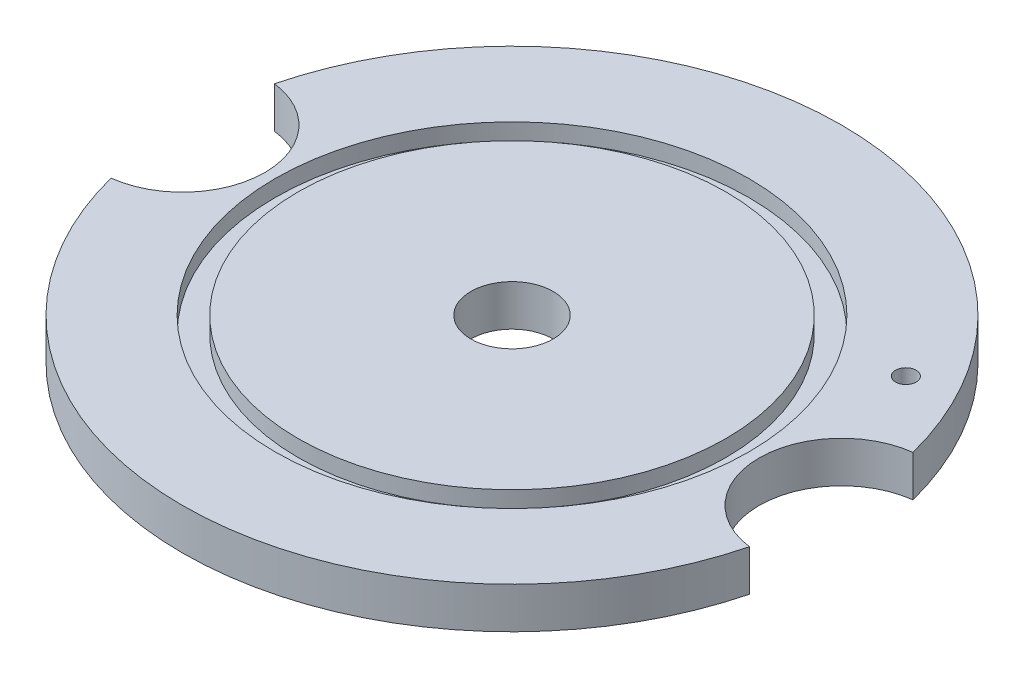
ISO-10303-21;
HEADER;
FILE_DESCRIPTION(('STEP AP214'),'2;1');
FILE_NAME('part.step','',(''),(''),'','','');
FILE_SCHEMA(('AUTOMOTIVE_DESIGN { 1 0 10303 214 1 1 1 1 }'));
ENDSEC;
DATA;
#1=APPLICATION_CONTEXT('core data for automotive mechanical design processes');
#2=APPLICATION_PROTOCOL_DEFINITION('international standard','automotive_design',2000,#1);
#3=PRODUCT_CONTEXT('',#1,'mechanical');
#4=PRODUCT('Part','Part','',(#3));
#5=PRODUCT_RELATED_PRODUCT_CATEGORY('part','',(#4));
#6=PRODUCT_DEFINITION_FORMATION('','',#4);
#7=PRODUCT_DEFINITION_CONTEXT('part definition',#1,'design');
#8=PRODUCT_DEFINITION('design','',#6,#7);
#9=PRODUCT_DEFINITION_SHAPE('','',#8);
#10=(LENGTH_UNIT() NAMED_UNIT(*) SI_UNIT(.MILLI.,.METRE.));
#11=(NAMED_UNIT(*) PLANE_ANGLE_UNIT() SI_UNIT($,.RADIAN.));
#12=(NAMED_UNIT(*) SI_UNIT($,.STERADIAN.) SOLID_ANGLE_UNIT());
#13=UNCERTAINTY_MEASURE_WITH_UNIT(LENGTH_MEASURE(1.E-05),#10,'distance_accuracy_value','');
#14=(GEOMETRIC_REPRESENTATION_CONTEXT(3) GLOBAL_UNCERTAINTY_ASSIGNED_CONTEXT((#13)) GLOBAL_UNIT_ASSIGNED_CONTEXT((#10,
#11,#12)) REPRESENTATION_CONTEXT('',''));
#15=CARTESIAN_POINT('',(0.,0.,0.));
#16=DIRECTION('',(0.,0.,1.));
#17=DIRECTION('',(1.,0.,0.));
#18=AXIS2_PLACEMENT_3D('',#15,#16,#17);
#19=CARTESIAN_POINT('',(0.,0.,0.));
#20=DIRECTION('',(0.,-1.,0.));
#21=DIRECTION('',(0.,0.,-1.));
#22=AXIS2_PLACEMENT_3D('',#19,#20,#21);
#23=CYLINDRICAL_SURFACE('',#22,50.8);
#24=CARTESIAN_POINT('',(0.,0.,0.));
#25=DIRECTION('',(0.,-1.,0.));
#26=DIRECTION('',(0.,0.,-1.));
#27=AXIS2_PLACEMENT_3D('',#24,#25,#26);
#28=CIRCLE('',#27,50.8);
#29=CARTESIAN_POINT('',(49.2125,0.,12.6003906189451));
#30=VERTEX_POINT('',#29);
#31=CARTESIAN_POINT('',(-49.2125,0.,12.6003906189451));
#32=VERTEX_POINT('',#31);
#33=EDGE_CURVE('E60',#30,#32,#28,.T.);
#34=ORIENTED_EDGE('',*,*,#33,.F.);
#35=DIRECTION('',(0.,1.,0.));
#36=VECTOR('',#35,1.);
#37=CARTESIAN_POINT('',(49.2125,3.175,12.6003906189451));
#38=LINE('',#37,#36);
#39=CARTESIAN_POINT('',(49.2125,6.35,12.6003906189451));
#40=VERTEX_POINT('',#39);
#41=EDGE_CURVE('E11',#30,#40,#38,.T.);
#42=ORIENTED_EDGE('',*,*,#41,.T.);
#43=CARTESIAN_POINT('',(0.,6.35,0.));
#44=DIRECTION('',(0.,-1.,0.));
#45=DIRECTION('',(0.,0.,-1.));
#46=AXIS2_PLACEMENT_3D('',#43,#44,#45);
#47=CIRCLE('',#46,50.8);
#48=CARTESIAN_POINT('',(-49.2125,6.35,12.6003906189451));
#49=VERTEX_POINT('',#48);
#50=EDGE_CURVE('E99',#40,#49,#47,.T.);
#51=ORIENTED_EDGE('',*,*,#50,.T.);
#52=DIRECTION('',(0.,1.,0.));
#53=VECTOR('',#52,1.);
#54=CARTESIAN_POINT('',(-49.2125,3.175,12.6003906189451));
#55=LINE('',#54,#53);
#56=EDGE_CURVE('E125',#49,#32,#55,.F.);
#57=ORIENTED_EDGE('',*,*,#56,.T.);
#58=EDGE_LOOP('',(#34,#42,#51,#57));
#59=FACE_BOUND('',#58,.T.);
#60=ADVANCED_FACE('F39',(#59),#23,.T.);
#61=CARTESIAN_POINT('',(0.,6.35,0.));
#62=DIRECTION('',(0.,-1.,0.));
#63=DIRECTION('',(0.,0.,-1.));
#64=AXIS2_PLACEMENT_3D('',#61,#62,#63);
#65=PLANE('',#64);
#66=CARTESIAN_POINT('',(0.,6.35,0.));
#67=DIRECTION('',(0.,1.,0.));
#68=DIRECTION('',(0.,0.,1.));
#69=AXIS2_PLACEMENT_3D('',#66,#67,#68);
#70=CIRCLE('',#69,6.35);
#71=CARTESIAN_POINT('',(0.,6.35,6.35));
#72=VERTEX_POINT('',#71);
#73=EDGE_CURVE('E148',#72,#72,#70,.T.);
#74=ORIENTED_EDGE('',*,*,#73,.F.);
#75=EDGE_LOOP('',(#74));
#76=FACE_BOUND('',#75,.T.);
#77=CARTESIAN_POINT('',(0.,6.35,0.));
#78=DIRECTION('',(0.,-1.,0.));
#79=DIRECTION('',(0.,0.,-1.));
#80=AXIS2_PLACEMENT_3D('',#77,#78,#79);
#81=CIRCLE('',#80,32.9565);
#82=CARTESIAN_POINT('',(0.,6.35,-32.9565));
#83=VERTEX_POINT('',#82);
#84=EDGE_CURVE('E121',#83,#83,#81,.T.);
#85=ORIENTED_EDGE('',*,*,#84,.F.);
#86=EDGE_LOOP('',(#85));
#87=FACE_BOUND('',#86,.T.);
#88=ADVANCED_FACE('F41',(#76,#87),#65,.F.);
#89=CARTESIAN_POINT('',(0.,0.,0.));
#90=DIRECTION('',(0.,-1.,0.));
#91=DIRECTION('',(0.,0.,-1.));
#92=AXIS2_PLACEMENT_3D('',#89,#90,#91);
#93=CYLINDRICAL_SURFACE('',#92,32.9565);
#94=CARTESIAN_POINT('',(0.,3.81,0.));
#95=DIRECTION('',(0.,-1.,0.));
#96=DIRECTION('',(0.,0.,-1.));
#97=AXIS2_PLACEMENT_3D('',#94,#95,#96);
#98=CIRCLE('',#97,32.9565);
#99=CARTESIAN_POINT('',(0.,3.81,-32.9565));
#100=VERTEX_POINT('',#99);
#101=EDGE_CURVE('E117',#100,#100,#98,.T.);
#102=ORIENTED_EDGE('',*,*,#101,.F.);
#103=EDGE_LOOP('',(#102));
#104=FACE_BOUND('',#103,.T.);
#105=ORIENTED_EDGE('',*,*,#84,.T.);
#106=EDGE_LOOP('',(#105));
#107=FACE_BOUND('',#106,.T.);
#108=ADVANCED_FACE('F175',(#104,#107),#93,.T.);
#109=CARTESIAN_POINT('',(-32.9565,3.81,0.));
#110=DIRECTION('',(0.,-1.,0.));
#111=DIRECTION('',(0.,0.,-1.));
#112=AXIS2_PLACEMENT_3D('',#109,#110,#111);
#113=PLANE('',#112);
#114=CARTESIAN_POINT('',(0.,3.81,0.));
#115=DIRECTION('',(0.,-1.,0.));
#116=DIRECTION('',(0.,0.,-1.));
#117=AXIS2_PLACEMENT_3D('',#114,#115,#116);
#118=CIRCLE('',#117,36.5125);
#119=CARTESIAN_POINT('',(0.,3.81,-36.5125));
#120=VERTEX_POINT('',#119);
#121=EDGE_CURVE('E113',#120,#120,#118,.T.);
#122=ORIENTED_EDGE('',*,*,#121,.F.);
#123=EDGE_LOOP('',(#122));
#124=FACE_BOUND('',#123,.T.);
#125=ORIENTED_EDGE('',*,*,#101,.T.);
#126=EDGE_LOOP('',(#125));
#127=FACE_BOUND('',#126,.T.);
#128=ADVANCED_FACE('F187',(#124,#127),#113,.F.);
#129=CARTESIAN_POINT('',(0.,0.,0.));
#130=DIRECTION('',(0.,-1.,0.));
#131=DIRECTION('',(0.,0.,-1.));
#132=AXIS2_PLACEMENT_3D('',#129,#130,#131);
#133=CYLINDRICAL_SURFACE('',#132,36.5125);
#134=CARTESIAN_POINT('',(0.,6.35,0.));
#135=DIRECTION('',(0.,-1.,0.));
#136=DIRECTION('',(0.,0.,-1.));
#137=AXIS2_PLACEMENT_3D('',#134,#135,#136);
#138=CIRCLE('',#137,36.5125);
#139=CARTESIAN_POINT('',(0.,6.35,-36.5125));
#140=VERTEX_POINT('',#139);
#141=EDGE_CURVE('E109',#140,#140,#138,.T.);
#142=ORIENTED_EDGE('',*,*,#141,.F.);
#143=EDGE_LOOP('',(#142));
#144=FACE_BOUND('',#143,.T.);
#145=ORIENTED_EDGE('',*,*,#121,.T.);
#146=EDGE_LOOP('',(#145));
#147=FACE_BOUND('',#146,.T.);
#148=ADVANCED_FACE('F182',(#144,#147),#133,.F.);
#149=CARTESIAN_POINT('',(-36.5125,6.35,0.));
#150=DIRECTION('',(0.,-1.,0.));
#151=DIRECTION('',(0.,0.,-1.));
#152=AXIS2_PLACEMENT_3D('',#149,#150,#151);
#153=PLANE('',#152);
#154=CARTESIAN_POINT('',(38.4948291982184,6.35,-22.2249999999998));
#155=DIRECTION('',(0.,1.,0.));
#156=DIRECTION('',(0.,0.,1.));
#157=AXIS2_PLACEMENT_3D('',#154,#155,#156);
#158=CIRCLE('',#157,1.5875);
#159=CARTESIAN_POINT('',(38.4948291982184,6.35,-20.6374999999998));
#160=VERTEX_POINT('',#159);
#161=EDGE_CURVE('E141',#160,#160,#158,.T.);
#162=ORIENTED_EDGE('',*,*,#161,.F.);
#163=EDGE_LOOP('',(#162));
#164=FACE_BOUND('',#163,.T.);
#165=ORIENTED_EDGE('',*,*,#50,.F.);
#166=CARTESIAN_POINT('',(50.8,6.35,0.));
#167=DIRECTION('',(0.,1.,0.));
#168=DIRECTION('',(0.,0.,1.));
#169=AXIS2_PLACEMENT_3D('',#166,#167,#168);
#170=CIRCLE('',#169,12.7);
#171=CARTESIAN_POINT('',(49.2125,6.35,-12.6003906189451));
#172=VERTEX_POINT('',#171);
#173=EDGE_CURVE('E84',#172,#40,#170,.T.);
#174=ORIENTED_EDGE('',*,*,#173,.F.);
#175=CARTESIAN_POINT('',(-49.2125,6.35,-12.6003906189451));
#176=VERTEX_POINT('',#175);
#177=EDGE_CURVE('E93',#176,#172,#47,.T.);
#178=ORIENTED_EDGE('',*,*,#177,.F.);
#179=CARTESIAN_POINT('',(-50.8,6.35,0.));
#180=DIRECTION('',(0.,1.,0.));
#181=DIRECTION('',(0.,0.,1.));
#182=AXIS2_PLACEMENT_3D('',#179,#180,#181);
#183=CIRCLE('',#182,12.7);
#184=EDGE_CURVE('E83',#49,#176,#183,.T.);
#185=ORIENTED_EDGE('',*,*,#184,.F.);
#186=EDGE_LOOP('',(#165,#174,#178,#185));
#187=FACE_BOUND('',#186,.T.);
#188=ORIENTED_EDGE('',*,*,#141,.T.);
#189=EDGE_LOOP('',(#188));
#190=FACE_BOUND('',#189,.T.);
#191=ADVANCED_FACE('F134',(#164,#187,#190),#153,.F.);
#192=ORIENTED_EDGE('',*,*,#177,.T.);
#193=DIRECTION('',(0.,1.,0.));
#194=VECTOR('',#193,1.);
#195=CARTESIAN_POINT('',(49.2125,3.175,-12.6003906189451));
#196=LINE('',#195,#194);
#197=CARTESIAN_POINT('',(49.2125,0.,-12.6003906189451));
#198=VERTEX_POINT('',#197);
#199=EDGE_CURVE('E48',#172,#198,#196,.F.);
#200=ORIENTED_EDGE('',*,*,#199,.T.);
#201=CARTESIAN_POINT('',(-49.2125,0.,-12.6003906189451));
#202=VERTEX_POINT('',#201);
#203=EDGE_CURVE('E91',#202,#198,#28,.T.);
#204=ORIENTED_EDGE('',*,*,#203,.F.);
#205=DIRECTION('',(0.,1.,0.));
#206=VECTOR('',#205,1.);
#207=CARTESIAN_POINT('',(-49.2125,3.175,-12.6003906189451));
#208=LINE('',#207,#206);
#209=EDGE_CURVE('E95',#202,#176,#208,.T.);
#210=ORIENTED_EDGE('',*,*,#209,.T.);
#211=EDGE_LOOP('',(#192,#200,#204,#210));
#212=FACE_BOUND('',#211,.T.);
#213=ADVANCED_FACE('F89',(#212),#23,.T.);
#214=CARTESIAN_POINT('',(0.,0.,0.));
#215=DIRECTION('',(0.,1.,0.));
#216=DIRECTION('',(0.,0.,1.));
#217=AXIS2_PLACEMENT_3D('',#214,#215,#216);
#218=PLANE('',#217);
#219=CARTESIAN_POINT('',(38.4948291982184,0.,-22.2249999999998));
#220=DIRECTION('',(0.,1.,0.));
#221=DIRECTION('',(0.,0.,1.));
#222=AXIS2_PLACEMENT_3D('',#219,#220,#221);
#223=CIRCLE('',#222,1.5875);
#224=CARTESIAN_POINT('',(38.4948291982184,0.,-20.6374999999998));
#225=VERTEX_POINT('',#224);
#226=EDGE_CURVE('E137',#225,#225,#223,.T.);
#227=ORIENTED_EDGE('',*,*,#226,.T.);
#228=EDGE_LOOP('',(#227));
#229=FACE_BOUND('',#228,.T.);
#230=CARTESIAN_POINT('',(0.,0.,0.));
#231=DIRECTION('',(0.,1.,0.));
#232=DIRECTION('',(0.,0.,1.));
#233=AXIS2_PLACEMENT_3D('',#230,#231,#232);
#234=CIRCLE('',#233,6.35);
#235=CARTESIAN_POINT('',(0.,0.,6.35));
#236=VERTEX_POINT('',#235);
#237=EDGE_CURVE('E104',#236,#236,#234,.T.);
#238=ORIENTED_EDGE('',*,*,#237,.T.);
#239=EDGE_LOOP('',(#238));
#240=FACE_BOUND('',#239,.T.);
#241=ORIENTED_EDGE('',*,*,#203,.T.);
#242=CARTESIAN_POINT('',(50.8,0.,0.));
#243=DIRECTION('',(0.,1.,0.));
#244=DIRECTION('',(0.,0.,1.));
#245=AXIS2_PLACEMENT_3D('',#242,#243,#244);
#246=CIRCLE('',#245,12.7);
#247=EDGE_CURVE('E77',#198,#30,#246,.T.);
#248=ORIENTED_EDGE('',*,*,#247,.T.);
#249=ORIENTED_EDGE('',*,*,#33,.T.);
#250=CARTESIAN_POINT('',(-50.8,0.,0.));
#251=DIRECTION('',(0.,1.,0.));
#252=DIRECTION('',(0.,0.,1.));
#253=AXIS2_PLACEMENT_3D('',#250,#251,#252);
#254=CIRCLE('',#253,12.7);
#255=EDGE_CURVE('E97',#32,#202,#254,.T.);
#256=ORIENTED_EDGE('',*,*,#255,.T.);
#257=EDGE_LOOP('',(#241,#248,#249,#256));
#258=FACE_BOUND('',#257,.T.);
#259=ADVANCED_FACE('F96',(#229,#240,#258),#218,.F.);
#260=CARTESIAN_POINT('',(0.,6.35,0.));
#261=DIRECTION('',(0.,1.,0.));
#262=DIRECTION('',(0.,0.,1.));
#263=AXIS2_PLACEMENT_3D('',#260,#261,#262);
#264=CYLINDRICAL_SURFACE('',#263,6.35);
#265=ORIENTED_EDGE('',*,*,#237,.F.);
#266=EDGE_LOOP('',(#265));
#267=FACE_BOUND('',#266,.T.);
#268=ORIENTED_EDGE('',*,*,#73,.T.);
#269=EDGE_LOOP('',(#268));
#270=FACE_BOUND('',#269,.T.);
#271=ADVANCED_FACE('F158',(#267,#270),#264,.F.);
#272=CARTESIAN_POINT('',(-50.8,6.35,0.));
#273=DIRECTION('',(0.,1.,0.));
#274=DIRECTION('',(0.,0.,1.));
#275=AXIS2_PLACEMENT_3D('',#272,#273,#274);
#276=CYLINDRICAL_SURFACE('',#275,12.7);
#277=ORIENTED_EDGE('',*,*,#255,.F.);
#278=ORIENTED_EDGE('',*,*,#56,.F.);
#279=ORIENTED_EDGE('',*,*,#184,.T.);
#280=ORIENTED_EDGE('',*,*,#209,.F.);
#281=EDGE_LOOP('',(#277,#278,#279,#280));
#282=FACE_BOUND('',#281,.T.);
#283=ADVANCED_FACE('F160',(#282),#276,.F.);
#284=CARTESIAN_POINT('',(50.8,6.35,0.));
#285=DIRECTION('',(0.,1.,0.));
#286=DIRECTION('',(0.,0.,1.));
#287=AXIS2_PLACEMENT_3D('',#284,#285,#286);
#288=CYLINDRICAL_SURFACE('',#287,12.7);
#289=ORIENTED_EDGE('',*,*,#247,.F.);
#290=ORIENTED_EDGE('',*,*,#199,.F.);
#291=ORIENTED_EDGE('',*,*,#173,.T.);
#292=ORIENTED_EDGE('',*,*,#41,.F.);
#293=EDGE_LOOP('',(#289,#290,#291,#292));
#294=FACE_BOUND('',#293,.T.);
#295=ADVANCED_FACE('F79',(#294),#288,.F.);
#296=CARTESIAN_POINT('',(38.4948291982184,6.35,-22.2249999999998));
#297=DIRECTION('',(0.,1.,0.));
#298=DIRECTION('',(0.,0.,1.));
#299=AXIS2_PLACEMENT_3D('',#296,#297,#298);
#300=CYLINDRICAL_SURFACE('',#299,1.5875);
#301=ORIENTED_EDGE('',*,*,#226,.F.);
#302=EDGE_LOOP('',(#301));
#303=FACE_BOUND('',#302,.T.);
#304=ORIENTED_EDGE('',*,*,#161,.T.);
#305=EDGE_LOOP('',(#304));
#306=FACE_BOUND('',#305,.T.);
#307=ADVANCED_FACE('F245',(#303,#306),#300,.F.);
#308=CLOSED_SHELL('',(#60,#88,#108,#128,#148,#191,#213,#259,#271,#283,#295,#307));
#309=MANIFOLD_SOLID_BREP('B2',#308);
#310=ADVANCED_BREP_SHAPE_REPRESENTATION('',(#18,#309),#14);
#311=SHAPE_DEFINITION_REPRESENTATION(#9,#310);
ENDSEC;
END-ISO-10303-21;
